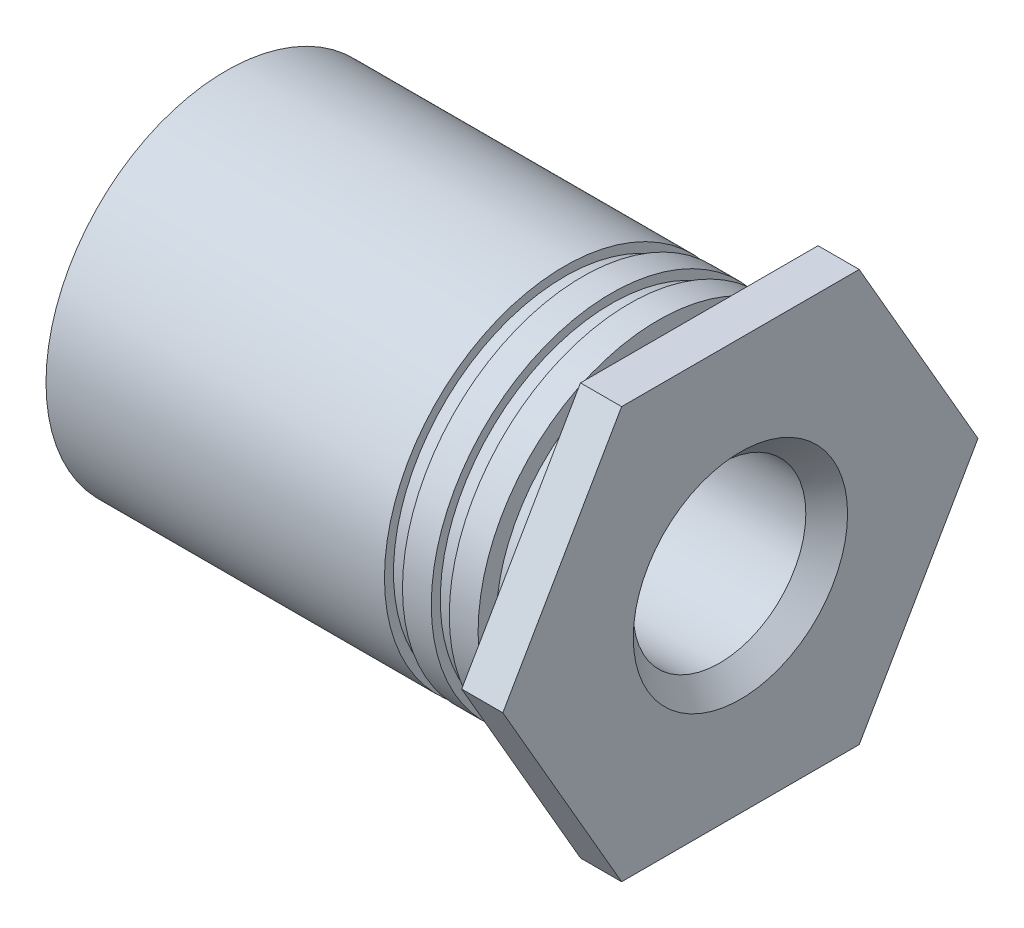
ISO-10303-21;
HEADER;
FILE_DESCRIPTION(('STEP AP214'),'2;1');
FILE_NAME('part.step','',(''),(''),'','','');
FILE_SCHEMA(('AUTOMOTIVE_DESIGN { 1 0 10303 214 1 1 1 1 }'));
ENDSEC;
DATA;
#1=APPLICATION_CONTEXT('core data for automotive mechanical design processes');
#2=APPLICATION_PROTOCOL_DEFINITION('international standard','automotive_design',2000,#1);
#3=PRODUCT_CONTEXT('',#1,'mechanical');
#4=PRODUCT('Part','Part','',(#3));
#5=PRODUCT_RELATED_PRODUCT_CATEGORY('part','',(#4));
#6=PRODUCT_DEFINITION_FORMATION('','',#4);
#7=PRODUCT_DEFINITION_CONTEXT('part definition',#1,'design');
#8=PRODUCT_DEFINITION('design','',#6,#7);
#9=PRODUCT_DEFINITION_SHAPE('','',#8);
#10=(LENGTH_UNIT() NAMED_UNIT(*) SI_UNIT(.MILLI.,.METRE.));
#11=(NAMED_UNIT(*) PLANE_ANGLE_UNIT() SI_UNIT($,.RADIAN.));
#12=(NAMED_UNIT(*) SI_UNIT($,.STERADIAN.) SOLID_ANGLE_UNIT());
#13=UNCERTAINTY_MEASURE_WITH_UNIT(LENGTH_MEASURE(1.E-05),#10,'distance_accuracy_value','');
#14=(GEOMETRIC_REPRESENTATION_CONTEXT(3) GLOBAL_UNCERTAINTY_ASSIGNED_CONTEXT((#13)) GLOBAL_UNIT_ASSIGNED_CONTEXT((#10,
#11,#12)) REPRESENTATION_CONTEXT('',''));
#15=CARTESIAN_POINT('',(0.,0.,0.));
#16=DIRECTION('',(0.,0.,1.));
#17=DIRECTION('',(1.,0.,0.));
#18=AXIS2_PLACEMENT_3D('',#15,#16,#17);
#19=CARTESIAN_POINT('',(-0.48,0.,1.05));
#20=DIRECTION('',(1.,0.,0.));
#21=DIRECTION('',(0.,0.,-1.));
#22=AXIS2_PLACEMENT_3D('',#19,#20,#21);
#23=PLANE('',#22);
#24=CARTESIAN_POINT('',(-0.48,0.,0.));
#25=DIRECTION('',(1.,0.,0.));
#26=DIRECTION('',(0.,0.,-1.));
#27=AXIS2_PLACEMENT_3D('',#24,#25,#26);
#28=CIRCLE('',#27,2.1);
#29=CARTESIAN_POINT('',(-0.48,0.,-2.1));
#30=VERTEX_POINT('',#29);
#31=EDGE_CURVE('E19',#30,#30,#28,.F.);
#32=ORIENTED_EDGE('',*,*,#31,.F.);
#33=EDGE_LOOP('',(#32));
#34=FACE_BOUND('',#33,.T.);
#35=CARTESIAN_POINT('',(-0.48,0.,0.));
#36=DIRECTION('',(1.,0.,0.));
#37=DIRECTION('',(0.,0.,-1.));
#38=AXIS2_PLACEMENT_3D('',#35,#36,#37);
#39=CIRCLE('',#38,1.89);
#40=CARTESIAN_POINT('',(-0.479999999999999,0.,-1.89));
#41=VERTEX_POINT('',#40);
#42=EDGE_CURVE('E129',#41,#41,#39,.T.);
#43=ORIENTED_EDGE('',*,*,#42,.F.);
#44=EDGE_LOOP('',(#43));
#45=FACE_BOUND('',#44,.T.);
#46=ADVANCED_FACE('F16',(#34,#45),#23,.T.);
#47=CARTESIAN_POINT('',(-3.,0.,0.));
#48=DIRECTION('',(1.,0.,0.));
#49=DIRECTION('',(0.,0.,-1.));
#50=AXIS2_PLACEMENT_3D('',#47,#48,#49);
#51=CYLINDRICAL_SURFACE('',#50,2.1);
#52=CARTESIAN_POINT('',(-0.816,0.,0.));
#53=DIRECTION('',(1.,0.,0.));
#54=DIRECTION('',(0.,0.,-1.));
#55=AXIS2_PLACEMENT_3D('',#52,#53,#54);
#56=CIRCLE('',#55,2.1);
#57=CARTESIAN_POINT('',(-0.816,0.,-2.1));
#58=VERTEX_POINT('',#57);
#59=EDGE_CURVE('E127',#58,#58,#56,.T.);
#60=ORIENTED_EDGE('',*,*,#59,.T.);
#61=EDGE_LOOP('',(#60));
#62=FACE_BOUND('',#61,.T.);
#63=ORIENTED_EDGE('',*,*,#31,.T.);
#64=EDGE_LOOP('',(#63));
#65=FACE_BOUND('',#64,.T.);
#66=ADVANCED_FACE('F136',(#62,#65),#51,.T.);
#67=CARTESIAN_POINT('',(-0.24,0.,0.));
#68=DIRECTION('',(1.,0.,0.));
#69=DIRECTION('',(0.,0.,-1.));
#70=AXIS2_PLACEMENT_3D('',#67,#68,#69);
#71=CYLINDRICAL_SURFACE('',#70,1.89);
#72=ORIENTED_EDGE('',*,*,#42,.T.);
#73=EDGE_LOOP('',(#72));
#74=FACE_BOUND('',#73,.T.);
#75=CARTESIAN_POINT('',(0.,0.,0.));
#76=DIRECTION('',(1.,0.,0.));
#77=DIRECTION('',(0.,0.,-1.));
#78=AXIS2_PLACEMENT_3D('',#75,#76,#77);
#79=CIRCLE('',#78,1.89);
#80=CARTESIAN_POINT('',(0.,0.,-1.89));
#81=VERTEX_POINT('',#80);
#82=EDGE_CURVE('E124',#81,#81,#79,.F.);
#83=ORIENTED_EDGE('',*,*,#82,.T.);
#84=EDGE_LOOP('',(#83));
#85=FACE_BOUND('',#84,.T.);
#86=ADVANCED_FACE('F144',(#74,#85),#71,.T.);
#87=CARTESIAN_POINT('',(-0.816000000000001,0.,2.0475));
#88=DIRECTION('',(1.,0.,0.));
#89=DIRECTION('',(0.,0.,-1.));
#90=AXIS2_PLACEMENT_3D('',#87,#88,#89);
#91=PLANE('',#90);
#92=ORIENTED_EDGE('',*,*,#59,.F.);
#93=EDGE_LOOP('',(#92));
#94=FACE_BOUND('',#93,.T.);
#95=CARTESIAN_POINT('',(-0.816,0.,0.));
#96=DIRECTION('',(1.,0.,0.));
#97=DIRECTION('',(0.,0.,-1.));
#98=AXIS2_PLACEMENT_3D('',#95,#96,#97);
#99=CIRCLE('',#98,1.995);
#100=CARTESIAN_POINT('',(-0.816,0.,-1.995));
#101=VERTEX_POINT('',#100);
#102=EDGE_CURVE('E80',#101,#101,#99,.F.);
#103=ORIENTED_EDGE('',*,*,#102,.F.);
#104=EDGE_LOOP('',(#103));
#105=FACE_BOUND('',#104,.T.);
#106=ADVANCED_FACE('F219',(#94,#105),#91,.F.);
#107=CARTESIAN_POINT('',(0.,0.,0.));
#108=DIRECTION('',(1.,0.,0.));
#109=DIRECTION('',(0.,1.,0.));
#110=AXIS2_PLACEMENT_3D('',#107,#108,#109);
#111=PLANE('',#110);
#112=ORIENTED_EDGE('',*,*,#82,.F.);
#113=EDGE_LOOP('',(#112));
#114=FACE_BOUND('',#113,.T.);
#115=DIRECTION('',(0.,0.,1.));
#116=VECTOR('',#115,1.);
#117=CARTESIAN_POINT('',(0.,2.4,1.3856406460551));
#118=LINE('',#117,#116);
#119=CARTESIAN_POINT('',(0.,2.4,-1.3856406460551));
#120=VERTEX_POINT('',#119);
#121=CARTESIAN_POINT('',(0.,2.4,1.3856406460551));
#122=VERTEX_POINT('',#121);
#123=EDGE_CURVE('E71',#120,#122,#118,.T.);
#124=ORIENTED_EDGE('',*,*,#123,.F.);
#125=DIRECTION('',(0.,0.866025403784439,0.5));
#126=VECTOR('',#125,1.);
#127=CARTESIAN_POINT('',(0.,2.4,-1.3856406460551));
#128=LINE('',#127,#126);
#129=CARTESIAN_POINT('',(0.,0.,-2.7712812921102));
#130=VERTEX_POINT('',#129);
#131=EDGE_CURVE('E420',#130,#120,#128,.T.);
#132=ORIENTED_EDGE('',*,*,#131,.F.);
#133=DIRECTION('',(0.,0.866025403784438,-0.5));
#134=VECTOR('',#133,1.);
#135=CARTESIAN_POINT('',(0.,0.,-2.7712812921102));
#136=LINE('',#135,#134);
#137=CARTESIAN_POINT('',(0.,-2.4,-1.3856406460551));
#138=VERTEX_POINT('',#137);
#139=EDGE_CURVE('E408',#138,#130,#136,.T.);
#140=ORIENTED_EDGE('',*,*,#139,.F.);
#141=DIRECTION('',(0.,0.,-1.));
#142=VECTOR('',#141,1.);
#143=CARTESIAN_POINT('',(0.,-2.4,-1.3856406460551));
#144=LINE('',#143,#142);
#145=CARTESIAN_POINT('',(0.,-2.4,1.3856406460551));
#146=VERTEX_POINT('',#145);
#147=EDGE_CURVE('E407',#146,#138,#144,.T.);
#148=ORIENTED_EDGE('',*,*,#147,.F.);
#149=DIRECTION('',(0.,-0.866025403784439,-0.5));
#150=VECTOR('',#149,1.);
#151=CARTESIAN_POINT('',(0.,-2.4,1.3856406460551));
#152=LINE('',#151,#150);
#153=CARTESIAN_POINT('',(0.,0.,2.7712812921102));
#154=VERTEX_POINT('',#153);
#155=EDGE_CURVE('E84',#154,#146,#152,.T.);
#156=ORIENTED_EDGE('',*,*,#155,.F.);
#157=DIRECTION('',(0.,-0.866025403784439,0.5));
#158=VECTOR('',#157,1.);
#159=CARTESIAN_POINT('',(0.,0.,2.7712812921102));
#160=LINE('',#159,#158);
#161=EDGE_CURVE('E66',#122,#154,#160,.T.);
#162=ORIENTED_EDGE('',*,*,#161,.F.);
#163=EDGE_LOOP('',(#124,#132,#140,#148,#156,#162));
#164=FACE_BOUND('',#163,.T.);
#165=ADVANCED_FACE('F82',(#114,#164),#111,.F.);
#166=CARTESIAN_POINT('',(-0.921,0.,0.));
#167=DIRECTION('',(1.,0.,0.));
#168=DIRECTION('',(0.,0.,-1.));
#169=AXIS2_PLACEMENT_3D('',#166,#167,#168);
#170=CYLINDRICAL_SURFACE('',#169,1.995);
#171=CARTESIAN_POINT('',(-1.026,0.,0.));
#172=DIRECTION('',(1.,0.,0.));
#173=DIRECTION('',(0.,0.,-1.));
#174=AXIS2_PLACEMENT_3D('',#171,#172,#173);
#175=CIRCLE('',#174,1.995);
#176=CARTESIAN_POINT('',(-1.026,0.,-1.995));
#177=VERTEX_POINT('',#176);
#178=EDGE_CURVE('E118',#177,#177,#175,.T.);
#179=ORIENTED_EDGE('',*,*,#178,.T.);
#180=EDGE_LOOP('',(#179));
#181=FACE_BOUND('',#180,.T.);
#182=ORIENTED_EDGE('',*,*,#102,.T.);
#183=EDGE_LOOP('',(#182));
#184=FACE_BOUND('',#183,.T.);
#185=ADVANCED_FACE('F213',(#181,#184),#170,.T.);
#186=CARTESIAN_POINT('',(0.,2.4,1.3856406460551));
#187=DIRECTION('',(0.,1.,0.));
#188=DIRECTION('',(0.,0.,1.));
#189=AXIS2_PLACEMENT_3D('',#186,#187,#188);
#190=PLANE('',#189);
#191=ORIENTED_EDGE('',*,*,#123,.T.);
#192=DIRECTION('',(1.,0.,0.));
#193=VECTOR('',#192,1.);
#194=CARTESIAN_POINT('',(0.,2.4,1.3856406460551));
#195=LINE('',#194,#193);
#196=CARTESIAN_POINT('',(0.48,2.4,1.3856406460551));
#197=VERTEX_POINT('',#196);
#198=EDGE_CURVE('E73',#197,#122,#195,.F.);
#199=ORIENTED_EDGE('',*,*,#198,.F.);
#200=DIRECTION('',(0.,0.,1.));
#201=VECTOR('',#200,1.);
#202=CARTESIAN_POINT('',(0.48,2.4,0.));
#203=LINE('',#202,#201);
#204=CARTESIAN_POINT('',(0.48,2.4,-1.3856406460551));
#205=VERTEX_POINT('',#204);
#206=EDGE_CURVE('E121',#205,#197,#203,.T.);
#207=ORIENTED_EDGE('',*,*,#206,.F.);
#208=DIRECTION('',(1.,0.,0.));
#209=VECTOR('',#208,1.);
#210=CARTESIAN_POINT('',(0.,2.4,-1.3856406460551));
#211=LINE('',#210,#209);
#212=EDGE_CURVE('E76',#120,#205,#211,.T.);
#213=ORIENTED_EDGE('',*,*,#212,.F.);
#214=EDGE_LOOP('',(#191,#199,#207,#213));
#215=FACE_BOUND('',#214,.T.);
#216=ADVANCED_FACE('F72',(#215),#190,.T.);
#217=CARTESIAN_POINT('',(0.,0.,2.7712812921102));
#218=DIRECTION('',(0.,0.5,0.866025403784439));
#219=DIRECTION('',(0.,-0.866025403784439,0.5));
#220=AXIS2_PLACEMENT_3D('',#217,#218,#219);
#221=PLANE('',#220);
#222=ORIENTED_EDGE('',*,*,#161,.T.);
#223=DIRECTION('',(1.,0.,0.));
#224=VECTOR('',#223,1.);
#225=CARTESIAN_POINT('',(0.,0.,2.7712812921102));
#226=LINE('',#225,#224);
#227=CARTESIAN_POINT('',(0.48,0.,2.7712812921102));
#228=VERTEX_POINT('',#227);
#229=EDGE_CURVE('E86',#228,#154,#226,.F.);
#230=ORIENTED_EDGE('',*,*,#229,.F.);
#231=DIRECTION('',(0.,-0.866025403784439,0.5));
#232=VECTOR('',#231,1.);
#233=CARTESIAN_POINT('',(0.48,2.4,1.3856406460551));
#234=LINE('',#233,#232);
#235=EDGE_CURVE('E90',#197,#228,#234,.T.);
#236=ORIENTED_EDGE('',*,*,#235,.F.);
#237=ORIENTED_EDGE('',*,*,#198,.T.);
#238=EDGE_LOOP('',(#222,#230,#236,#237));
#239=FACE_BOUND('',#238,.T.);
#240=ADVANCED_FACE('F88',(#239),#221,.T.);
#241=CARTESIAN_POINT('',(0.,-2.4,1.3856406460551));
#242=DIRECTION('',(0.,-0.5,0.866025403784439));
#243=DIRECTION('',(0.,-0.866025403784439,-0.5));
#244=AXIS2_PLACEMENT_3D('',#241,#242,#243);
#245=PLANE('',#244);
#246=ORIENTED_EDGE('',*,*,#155,.T.);
#247=DIRECTION('',(1.,0.,0.));
#248=VECTOR('',#247,1.);
#249=CARTESIAN_POINT('',(0.,-2.4,1.3856406460551));
#250=LINE('',#249,#248);
#251=CARTESIAN_POINT('',(0.48,-2.4,1.3856406460551));
#252=VERTEX_POINT('',#251);
#253=EDGE_CURVE('E403',#252,#146,#250,.F.);
#254=ORIENTED_EDGE('',*,*,#253,.F.);
#255=DIRECTION('',(0.,-0.866025403784439,-0.5));
#256=VECTOR('',#255,1.);
#257=CARTESIAN_POINT('',(0.48,0.,2.7712812921102));
#258=LINE('',#257,#256);
#259=EDGE_CURVE('E425',#228,#252,#258,.T.);
#260=ORIENTED_EDGE('',*,*,#259,.F.);
#261=ORIENTED_EDGE('',*,*,#229,.T.);
#262=EDGE_LOOP('',(#246,#254,#260,#261));
#263=FACE_BOUND('',#262,.T.);
#264=ADVANCED_FACE('F204',(#263),#245,.T.);
#265=CARTESIAN_POINT('',(0.,-2.4,-1.3856406460551));
#266=DIRECTION('',(0.,-1.,0.));
#267=DIRECTION('',(0.,0.,-1.));
#268=AXIS2_PLACEMENT_3D('',#265,#266,#267);
#269=PLANE('',#268);
#270=ORIENTED_EDGE('',*,*,#147,.T.);
#271=DIRECTION('',(1.,0.,0.));
#272=VECTOR('',#271,1.);
#273=CARTESIAN_POINT('',(0.,-2.4,-1.3856406460551));
#274=LINE('',#273,#272);
#275=CARTESIAN_POINT('',(0.48,-2.4,-1.3856406460551));
#276=VERTEX_POINT('',#275);
#277=EDGE_CURVE('E410',#276,#138,#274,.F.);
#278=ORIENTED_EDGE('',*,*,#277,.F.);
#279=DIRECTION('',(0.,0.,1.));
#280=VECTOR('',#279,1.);
#281=CARTESIAN_POINT('',(0.48,-2.4,0.));
#282=LINE('',#281,#280);
#283=EDGE_CURVE('E413',#252,#276,#282,.F.);
#284=ORIENTED_EDGE('',*,*,#283,.F.);
#285=ORIENTED_EDGE('',*,*,#253,.T.);
#286=EDGE_LOOP('',(#270,#278,#284,#285));
#287=FACE_BOUND('',#286,.T.);
#288=ADVANCED_FACE('F201',(#287),#269,.T.);
#289=CARTESIAN_POINT('',(0.,0.,-2.7712812921102));
#290=DIRECTION('',(0.,-0.5,-0.866025403784438));
#291=DIRECTION('',(0.,0.866025403784438,-0.5));
#292=AXIS2_PLACEMENT_3D('',#289,#290,#291);
#293=PLANE('',#292);
#294=ORIENTED_EDGE('',*,*,#139,.T.);
#295=DIRECTION('',(1.,0.,0.));
#296=VECTOR('',#295,1.);
#297=CARTESIAN_POINT('',(0.,0.,-2.7712812921102));
#298=LINE('',#297,#296);
#299=CARTESIAN_POINT('',(0.48,0.,-2.7712812921102));
#300=VERTEX_POINT('',#299);
#301=EDGE_CURVE('E34',#300,#130,#298,.F.);
#302=ORIENTED_EDGE('',*,*,#301,.F.);
#303=DIRECTION('',(0.,0.866025403784439,-0.5));
#304=VECTOR('',#303,1.);
#305=CARTESIAN_POINT('',(0.48,-2.4,-1.3856406460551));
#306=LINE('',#305,#304);
#307=EDGE_CURVE('E428',#276,#300,#306,.T.);
#308=ORIENTED_EDGE('',*,*,#307,.F.);
#309=ORIENTED_EDGE('',*,*,#277,.T.);
#310=EDGE_LOOP('',(#294,#302,#308,#309));
#311=FACE_BOUND('',#310,.T.);
#312=ADVANCED_FACE('F197',(#311),#293,.T.);
#313=CARTESIAN_POINT('',(0.,2.4,-1.3856406460551));
#314=DIRECTION('',(0.,0.5,-0.866025403784439));
#315=DIRECTION('',(0.,0.866025403784439,0.5));
#316=AXIS2_PLACEMENT_3D('',#313,#314,#315);
#317=PLANE('',#316);
#318=ORIENTED_EDGE('',*,*,#131,.T.);
#319=ORIENTED_EDGE('',*,*,#212,.T.);
#320=DIRECTION('',(0.,0.866025403784439,0.499999999999999));
#321=VECTOR('',#320,1.);
#322=CARTESIAN_POINT('',(0.48,0.,-2.7712812921102));
#323=LINE('',#322,#321);
#324=EDGE_CURVE('E117',#300,#205,#323,.T.);
#325=ORIENTED_EDGE('',*,*,#324,.F.);
#326=ORIENTED_EDGE('',*,*,#301,.T.);
#327=EDGE_LOOP('',(#318,#319,#325,#326));
#328=FACE_BOUND('',#327,.T.);
#329=ADVANCED_FACE('F193',(#328),#317,.T.);
#330=CARTESIAN_POINT('',(-1.026,0.,2.0475));
#331=DIRECTION('',(-1.,0.,0.));
#332=DIRECTION('',(0.,0.,1.));
#333=AXIS2_PLACEMENT_3D('',#330,#331,#332);
#334=PLANE('',#333);
#335=ORIENTED_EDGE('',*,*,#178,.F.);
#336=EDGE_LOOP('',(#335));
#337=FACE_BOUND('',#336,.T.);
#338=CARTESIAN_POINT('',(-1.026,0.,0.));
#339=DIRECTION('',(1.,0.,0.));
#340=DIRECTION('',(0.,0.,-1.));
#341=AXIS2_PLACEMENT_3D('',#338,#339,#340);
#342=CIRCLE('',#341,2.1);
#343=CARTESIAN_POINT('',(-1.026,0.,-2.1));
#344=VERTEX_POINT('',#343);
#345=EDGE_CURVE('E114',#344,#344,#342,.F.);
#346=ORIENTED_EDGE('',*,*,#345,.F.);
#347=EDGE_LOOP('',(#346));
#348=FACE_BOUND('',#347,.T.);
#349=ADVANCED_FACE('F189',(#337,#348),#334,.F.);
#350=CARTESIAN_POINT('',(0.48,0.,0.));
#351=DIRECTION('',(1.,0.,0.));
#352=DIRECTION('',(0.,1.,0.));
#353=AXIS2_PLACEMENT_3D('',#350,#351,#352);
#354=PLANE('',#353);
#355=ORIENTED_EDGE('',*,*,#307,.T.);
#356=ORIENTED_EDGE('',*,*,#324,.T.);
#357=ORIENTED_EDGE('',*,*,#206,.T.);
#358=ORIENTED_EDGE('',*,*,#235,.T.);
#359=ORIENTED_EDGE('',*,*,#259,.T.);
#360=ORIENTED_EDGE('',*,*,#283,.T.);
#361=EDGE_LOOP('',(#355,#356,#357,#358,#359,#360));
#362=FACE_BOUND('',#361,.T.);
#363=CARTESIAN_POINT('',(0.479999999981828,0.,0.));
#364=DIRECTION('',(1.,0.,0.));
#365=DIRECTION('',(0.,0.,-1.));
#366=AXIS2_PLACEMENT_3D('',#363,#364,#365);
#367=CIRCLE('',#366,1.25000000002728);
#368=CARTESIAN_POINT('',(0.479999999981828,0.,-1.25000000002728));
#369=VERTEX_POINT('',#368);
#370=EDGE_CURVE('E111',#369,#369,#367,.F.);
#371=ORIENTED_EDGE('',*,*,#370,.T.);
#372=EDGE_LOOP('',(#371));
#373=FACE_BOUND('',#372,.T.);
#374=ADVANCED_FACE('F185',(#362,#373),#354,.T.);
#375=CARTESIAN_POINT('',(-3.,0.,0.));
#376=DIRECTION('',(1.,0.,0.));
#377=DIRECTION('',(0.,0.,-1.));
#378=AXIS2_PLACEMENT_3D('',#375,#376,#377);
#379=CYLINDRICAL_SURFACE('',#378,2.1);
#380=CARTESIAN_POINT('',(-1.362,0.,0.));
#381=DIRECTION('',(1.,0.,0.));
#382=DIRECTION('',(0.,0.,-1.));
#383=AXIS2_PLACEMENT_3D('',#380,#381,#382);
#384=CIRCLE('',#383,2.1);
#385=CARTESIAN_POINT('',(-1.362,0.,-2.1));
#386=VERTEX_POINT('',#385);
#387=EDGE_CURVE('E108',#386,#386,#384,.T.);
#388=ORIENTED_EDGE('',*,*,#387,.T.);
#389=EDGE_LOOP('',(#388));
#390=FACE_BOUND('',#389,.T.);
#391=ORIENTED_EDGE('',*,*,#345,.T.);
#392=EDGE_LOOP('',(#391));
#393=FACE_BOUND('',#392,.T.);
#394=ADVANCED_FACE('F181',(#390,#393),#379,.T.);
#395=CARTESIAN_POINT('',(0.479999999924985,0.,0.));
#396=DIRECTION('',(1.,0.,0.));
#397=DIRECTION('',(0.,0.,-1.));
#398=AXIS2_PLACEMENT_3D('',#395,#396,#397);
#399=CONICAL_SURFACE('',#398,1.24999999997044,0.785398163280727);
#400=ORIENTED_EDGE('',*,*,#370,.F.);
#401=EDGE_LOOP('',(#400));
#402=FACE_BOUND('',#401,.T.);
#403=CARTESIAN_POINT('',(0.2365,0.,0.));
#404=DIRECTION('',(1.,0.,0.));
#405=DIRECTION('',(0.,0.,-1.));
#406=AXIS2_PLACEMENT_3D('',#403,#404,#405);
#407=CIRCLE('',#406,1.0065);
#408=CARTESIAN_POINT('',(0.2365,0.,-1.0065));
#409=VERTEX_POINT('',#408);
#410=EDGE_CURVE('E107',#409,#409,#407,.F.);
#411=ORIENTED_EDGE('',*,*,#410,.T.);
#412=EDGE_LOOP('',(#411));
#413=FACE_BOUND('',#412,.T.);
#414=ADVANCED_FACE('F177',(#402,#413),#399,.F.);
#415=CARTESIAN_POINT('',(-1.362,0.,2.0475));
#416=DIRECTION('',(1.,0.,0.));
#417=DIRECTION('',(0.,0.,-1.));
#418=AXIS2_PLACEMENT_3D('',#415,#416,#417);
#419=PLANE('',#418);
#420=ORIENTED_EDGE('',*,*,#387,.F.);
#421=EDGE_LOOP('',(#420));
#422=FACE_BOUND('',#421,.T.);
#423=CARTESIAN_POINT('',(-1.362,0.,0.));
#424=DIRECTION('',(1.,0.,0.));
#425=DIRECTION('',(0.,0.,-1.));
#426=AXIS2_PLACEMENT_3D('',#423,#424,#425);
#427=CIRCLE('',#426,1.995);
#428=CARTESIAN_POINT('',(-1.362,0.,-1.995));
#429=VERTEX_POINT('',#428);
#430=EDGE_CURVE('E104',#429,#429,#427,.F.);
#431=ORIENTED_EDGE('',*,*,#430,.F.);
#432=EDGE_LOOP('',(#431));
#433=FACE_BOUND('',#432,.T.);
#434=ADVANCED_FACE('F173',(#422,#433),#419,.F.);
#435=CARTESIAN_POINT('',(-2.52,0.,0.));
#436=DIRECTION('',(1.,0.,0.));
#437=DIRECTION('',(0.,0.,-1.));
#438=AXIS2_PLACEMENT_3D('',#435,#436,#437);
#439=CYLINDRICAL_SURFACE('',#438,1.0065);
#440=ORIENTED_EDGE('',*,*,#410,.F.);
#441=EDGE_LOOP('',(#440));
#442=FACE_BOUND('',#441,.T.);
#443=CARTESIAN_POINT('',(-5.27649999997948,0.,0.));
#444=DIRECTION('',(-1.,0.,0.));
#445=DIRECTION('',(0.,0.,-1.));
#446=AXIS2_PLACEMENT_3D('',#443,#444,#445);
#447=CIRCLE('',#446,1.00650000007363);
#448=CARTESIAN_POINT('',(-5.27649999997948,0.,-1.00650000007363));
#449=VERTEX_POINT('',#448);
#450=EDGE_CURVE('E103',#449,#449,#447,.T.);
#451=ORIENTED_EDGE('',*,*,#450,.T.);
#452=EDGE_LOOP('',(#451));
#453=FACE_BOUND('',#452,.T.);
#454=ADVANCED_FACE('F169',(#442,#453),#439,.F.);
#455=CARTESIAN_POINT('',(-1.467,0.,0.));
#456=DIRECTION('',(1.,0.,0.));
#457=DIRECTION('',(0.,0.,-1.));
#458=AXIS2_PLACEMENT_3D('',#455,#456,#457);
#459=CYLINDRICAL_SURFACE('',#458,1.995);
#460=CARTESIAN_POINT('',(-1.572,0.,0.));
#461=DIRECTION('',(1.,0.,0.));
#462=DIRECTION('',(0.,0.,-1.));
#463=AXIS2_PLACEMENT_3D('',#460,#461,#462);
#464=CIRCLE('',#463,1.995);
#465=CARTESIAN_POINT('',(-1.572,0.,-1.995));
#466=VERTEX_POINT('',#465);
#467=EDGE_CURVE('E100',#466,#466,#464,.T.);
#468=ORIENTED_EDGE('',*,*,#467,.T.);
#469=EDGE_LOOP('',(#468));
#470=FACE_BOUND('',#469,.T.);
#471=ORIENTED_EDGE('',*,*,#430,.T.);
#472=EDGE_LOOP('',(#471));
#473=FACE_BOUND('',#472,.T.);
#474=ADVANCED_FACE('F165',(#470,#473),#459,.T.);
#475=CARTESIAN_POINT('',(-5.51999999993313,0.,0.));
#476=DIRECTION('',(-1.,0.,0.));
#477=DIRECTION('',(0.,0.,1.));
#478=AXIS2_PLACEMENT_3D('',#475,#476,#477);
#479=CONICAL_SURFACE('',#478,1.24999999997044,0.785398163397448);
#480=ORIENTED_EDGE('',*,*,#450,.F.);
#481=EDGE_LOOP('',(#480));
#482=FACE_BOUND('',#481,.T.);
#483=CARTESIAN_POINT('',(-5.51999999998998,0.,0.));
#484=DIRECTION('',(-1.,0.,0.));
#485=DIRECTION('',(0.,0.,1.));
#486=AXIS2_PLACEMENT_3D('',#483,#484,#485);
#487=CIRCLE('',#486,1.25000000002728);
#488=CARTESIAN_POINT('',(-5.51999999998998,0.,1.25000000002728));
#489=VERTEX_POINT('',#488);
#490=EDGE_CURVE('E97',#489,#489,#487,.F.);
#491=ORIENTED_EDGE('',*,*,#490,.F.);
#492=EDGE_LOOP('',(#491));
#493=FACE_BOUND('',#492,.T.);
#494=ADVANCED_FACE('F161',(#482,#493),#479,.F.);
#495=CARTESIAN_POINT('',(-1.572,0.,2.0475));
#496=DIRECTION('',(-1.,0.,0.));
#497=DIRECTION('',(0.,0.,1.));
#498=AXIS2_PLACEMENT_3D('',#495,#496,#497);
#499=PLANE('',#498);
#500=ORIENTED_EDGE('',*,*,#467,.F.);
#501=EDGE_LOOP('',(#500));
#502=FACE_BOUND('',#501,.T.);
#503=CARTESIAN_POINT('',(-1.572,0.,0.));
#504=DIRECTION('',(1.,0.,0.));
#505=DIRECTION('',(0.,0.,-1.));
#506=AXIS2_PLACEMENT_3D('',#503,#504,#505);
#507=CIRCLE('',#506,2.1);
#508=CARTESIAN_POINT('',(-1.572,0.,-2.1));
#509=VERTEX_POINT('',#508);
#510=EDGE_CURVE('E25',#509,#509,#507,.F.);
#511=ORIENTED_EDGE('',*,*,#510,.F.);
#512=EDGE_LOOP('',(#511));
#513=FACE_BOUND('',#512,.T.);
#514=ADVANCED_FACE('F154',(#502,#513),#499,.F.);
#515=CARTESIAN_POINT('',(-5.52,0.,1.05));
#516=DIRECTION('',(-1.,0.,0.));
#517=DIRECTION('',(0.,0.,1.));
#518=AXIS2_PLACEMENT_3D('',#515,#516,#517);
#519=PLANE('',#518);
#520=CARTESIAN_POINT('',(-5.52,0.,0.));
#521=DIRECTION('',(1.,0.,0.));
#522=DIRECTION('',(0.,0.,-1.));
#523=AXIS2_PLACEMENT_3D('',#520,#521,#522);
#524=CIRCLE('',#523,2.1);
#525=CARTESIAN_POINT('',(-5.52,0.,-2.1));
#526=VERTEX_POINT('',#525);
#527=EDGE_CURVE('E10',#526,#526,#524,.T.);
#528=ORIENTED_EDGE('',*,*,#527,.F.);
#529=EDGE_LOOP('',(#528));
#530=FACE_BOUND('',#529,.T.);
#531=ORIENTED_EDGE('',*,*,#490,.T.);
#532=EDGE_LOOP('',(#531));
#533=FACE_BOUND('',#532,.T.);
#534=ADVANCED_FACE('F148',(#530,#533),#519,.T.);
#535=CARTESIAN_POINT('',(-3.,0.,0.));
#536=DIRECTION('',(1.,0.,0.));
#537=DIRECTION('',(0.,0.,-1.));
#538=AXIS2_PLACEMENT_3D('',#535,#536,#537);
#539=CYLINDRICAL_SURFACE('',#538,2.1);
#540=ORIENTED_EDGE('',*,*,#510,.T.);
#541=EDGE_LOOP('',(#540));
#542=FACE_BOUND('',#541,.T.);
#543=ORIENTED_EDGE('',*,*,#527,.T.);
#544=EDGE_LOOP('',(#543));
#545=FACE_BOUND('',#544,.T.);
#546=ADVANCED_FACE('F146',(#542,#545),#539,.T.);
#547=CLOSED_SHELL('',(#46,#66,#86,#106,#165,#185,#216,#240,#264,#288,#312,#329,#349,#374,#394,
#414,#434,#454,#474,#494,#514,#534,#546));
#548=MANIFOLD_SOLID_BREP('B1',#547);
#549=ADVANCED_BREP_SHAPE_REPRESENTATION('',(#18,#548),#14);
#550=SHAPE_DEFINITION_REPRESENTATION(#9,#549);
ENDSEC;
END-ISO-10303-21;
